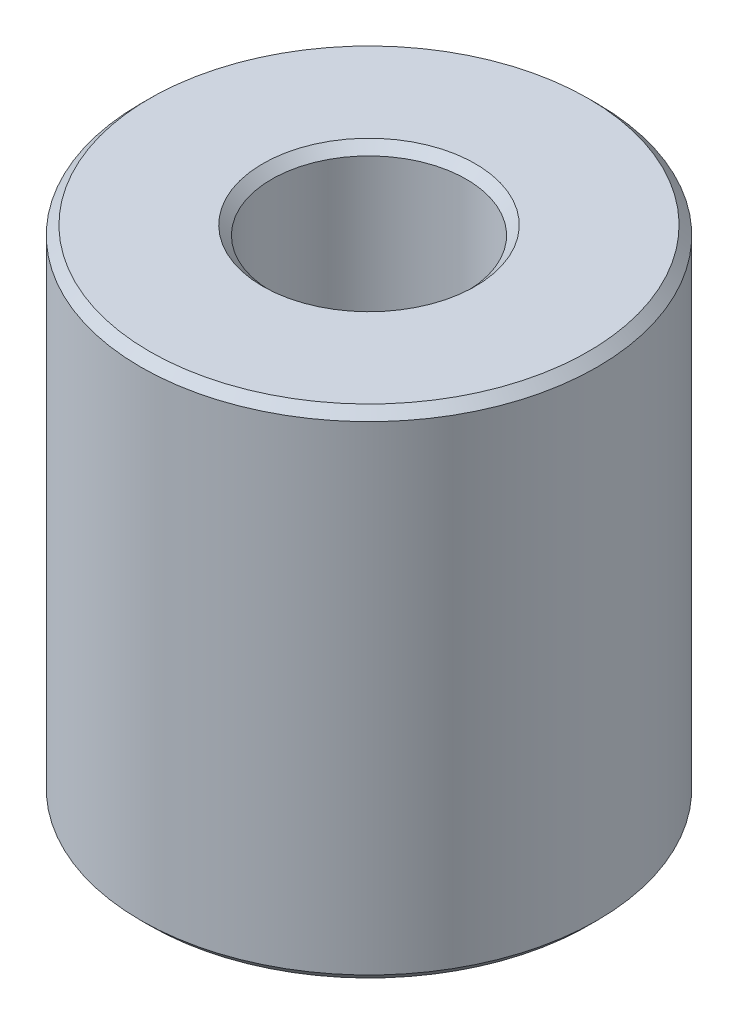
ISO-10303-21;
HEADER;
FILE_DESCRIPTION(('STEP AP214'),'2;1');
FILE_NAME('part.step','',(''),(''),'','','');
FILE_SCHEMA(('AUTOMOTIVE_DESIGN { 1 0 10303 214 1 1 1 1 }'));
ENDSEC;
DATA;
#1=APPLICATION_CONTEXT('core data for automotive mechanical design processes');
#2=APPLICATION_PROTOCOL_DEFINITION('international standard','automotive_design',2000,#1);
#3=PRODUCT_CONTEXT('',#1,'mechanical');
#4=PRODUCT('Part','Part','',(#3));
#5=PRODUCT_RELATED_PRODUCT_CATEGORY('part','',(#4));
#6=PRODUCT_DEFINITION_FORMATION('','',#4);
#7=PRODUCT_DEFINITION_CONTEXT('part definition',#1,'design');
#8=PRODUCT_DEFINITION('design','',#6,#7);
#9=PRODUCT_DEFINITION_SHAPE('','',#8);
#10=(LENGTH_UNIT() NAMED_UNIT(*) SI_UNIT(.MILLI.,.METRE.));
#11=(NAMED_UNIT(*) PLANE_ANGLE_UNIT() SI_UNIT($,.RADIAN.));
#12=(NAMED_UNIT(*) SI_UNIT($,.STERADIAN.) SOLID_ANGLE_UNIT());
#13=UNCERTAINTY_MEASURE_WITH_UNIT(LENGTH_MEASURE(1.E-05),#10,'distance_accuracy_value','');
#14=(GEOMETRIC_REPRESENTATION_CONTEXT(3) GLOBAL_UNCERTAINTY_ASSIGNED_CONTEXT((#13)) GLOBAL_UNIT_ASSIGNED_CONTEXT((#10,
#11,#12)) REPRESENTATION_CONTEXT('',''));
#15=CARTESIAN_POINT('',(0.,0.,0.));
#16=DIRECTION('',(0.,0.,1.));
#17=DIRECTION('',(1.,0.,0.));
#18=AXIS2_PLACEMENT_3D('',#15,#16,#17);
#19=CARTESIAN_POINT('',(0.,59.89815823762,0.));
#20=DIRECTION('',(0.,-1.,0.));
#21=DIRECTION('',(0.,0.,-1.));
#22=AXIS2_PLACEMENT_3D('',#19,#20,#21);
#23=CYLINDRICAL_SURFACE('',#22,27.5);
#24=CARTESIAN_POINT('',(0.,1.0791281320796,0.));
#25=DIRECTION('',(0.,1.,0.));
#26=DIRECTION('',(0.,0.,1.));
#27=AXIS2_PLACEMENT_3D('',#24,#25,#26);
#28=CIRCLE('',#27,27.5);
#29=CARTESIAN_POINT('',(0.,1.0791281320796,27.5));
#30=VERTEX_POINT('',#29);
#31=EDGE_CURVE('E10',#30,#30,#28,.T.);
#32=ORIENTED_EDGE('',*,*,#31,.T.);
#33=EDGE_LOOP('',(#32));
#34=FACE_BOUND('',#33,.T.);
#35=CARTESIAN_POINT('',(0.,58.8190301055405,0.));
#36=DIRECTION('',(0.,1.,0.));
#37=DIRECTION('',(0.,0.,1.));
#38=AXIS2_PLACEMENT_3D('',#35,#36,#37);
#39=CIRCLE('',#38,27.5);
#40=CARTESIAN_POINT('',(0.,58.8190301055405,-27.5));
#41=VERTEX_POINT('',#40);
#42=EDGE_CURVE('E50',#41,#41,#39,.F.);
#43=ORIENTED_EDGE('',*,*,#42,.T.);
#44=EDGE_LOOP('',(#43));
#45=FACE_BOUND('',#44,.T.);
#46=ADVANCED_FACE('F39',(#34,#45),#23,.T.);
#47=CARTESIAN_POINT('',(0.,59.89815823762,0.));
#48=DIRECTION('',(0.,1.,0.));
#49=DIRECTION('',(0.,0.,1.));
#50=AXIS2_PLACEMENT_3D('',#47,#48,#49);
#51=PLANE('',#50);
#52=CARTESIAN_POINT('',(0.,59.89815823762,0.));
#53=DIRECTION('',(0.,1.,0.));
#54=DIRECTION('',(0.,0.,1.));
#55=AXIS2_PLACEMENT_3D('',#52,#53,#54);
#56=CIRCLE('',#55,12.8058354694121);
#57=CARTESIAN_POINT('',(0.,59.89815823762,12.8058354694121));
#58=VERTEX_POINT('',#57);
#59=EDGE_CURVE('E58',#58,#58,#56,.F.);
#60=ORIENTED_EDGE('',*,*,#59,.T.);
#61=EDGE_LOOP('',(#60));
#62=FACE_BOUND('',#61,.T.);
#63=CARTESIAN_POINT('',(0.,59.89815823762,0.));
#64=DIRECTION('',(0.,1.,0.));
#65=DIRECTION('',(0.,0.,1.));
#66=AXIS2_PLACEMENT_3D('',#63,#64,#65);
#67=CIRCLE('',#66,26.4208718679204);
#68=CARTESIAN_POINT('',(0.,59.89815823762,-26.4208718679204));
#69=VERTEX_POINT('',#68);
#70=EDGE_CURVE('E61',#69,#69,#67,.T.);
#71=ORIENTED_EDGE('',*,*,#70,.T.);
#72=EDGE_LOOP('',(#71));
#73=FACE_BOUND('',#72,.T.);
#74=ADVANCED_FACE('F88',(#62,#73),#51,.T.);
#75=CARTESIAN_POINT('',(0.,0.,0.));
#76=DIRECTION('',(0.,1.,0.));
#77=DIRECTION('',(0.,0.,1.));
#78=AXIS2_PLACEMENT_3D('',#75,#76,#77);
#79=PLANE('',#78);
#80=CARTESIAN_POINT('',(0.,0.,0.));
#81=DIRECTION('',(0.,1.,0.));
#82=DIRECTION('',(0.,0.,1.));
#83=AXIS2_PLACEMENT_3D('',#80,#81,#82);
#84=CIRCLE('',#83,12.805835469412);
#85=CARTESIAN_POINT('',(0.,0.,12.805835469412));
#86=VERTEX_POINT('',#85);
#87=EDGE_CURVE('E51',#86,#86,#84,.T.);
#88=ORIENTED_EDGE('',*,*,#87,.T.);
#89=EDGE_LOOP('',(#88));
#90=FACE_BOUND('',#89,.T.);
#91=CARTESIAN_POINT('',(0.,0.,0.));
#92=DIRECTION('',(0.,1.,0.));
#93=DIRECTION('',(0.,0.,1.));
#94=AXIS2_PLACEMENT_3D('',#91,#92,#93);
#95=CIRCLE('',#94,26.4208718679204);
#96=CARTESIAN_POINT('',(0.,0.,26.4208718679204));
#97=VERTEX_POINT('',#96);
#98=EDGE_CURVE('E54',#97,#97,#95,.F.);
#99=ORIENTED_EDGE('',*,*,#98,.T.);
#100=EDGE_LOOP('',(#99));
#101=FACE_BOUND('',#100,.T.);
#102=ADVANCED_FACE('F83',(#90,#101),#79,.F.);
#103=CARTESIAN_POINT('',(0.,59.89815823762,0.));
#104=DIRECTION('',(0.,-1.,0.));
#105=DIRECTION('',(0.,0.,-1.));
#106=AXIS2_PLACEMENT_3D('',#103,#104,#105);
#107=CYLINDRICAL_SURFACE('',#106,11.7267073373325);
#108=CARTESIAN_POINT('',(0.,58.8190301055405,0.));
#109=DIRECTION('',(0.,1.,0.));
#110=DIRECTION('',(0.,0.,1.));
#111=AXIS2_PLACEMENT_3D('',#108,#109,#110);
#112=CIRCLE('',#111,11.7267073373325);
#113=CARTESIAN_POINT('',(0.,58.8190301055405,11.7267073373325));
#114=VERTEX_POINT('',#113);
#115=EDGE_CURVE('E67',#114,#114,#112,.T.);
#116=ORIENTED_EDGE('',*,*,#115,.T.);
#117=EDGE_LOOP('',(#116));
#118=FACE_BOUND('',#117,.T.);
#119=CARTESIAN_POINT('',(0.,1.0791281320796,0.));
#120=DIRECTION('',(0.,1.,0.));
#121=DIRECTION('',(0.,0.,1.));
#122=AXIS2_PLACEMENT_3D('',#119,#120,#121);
#123=CIRCLE('',#122,11.7267073373325);
#124=CARTESIAN_POINT('',(0.,1.0791281320796,11.7267073373325));
#125=VERTEX_POINT('',#124);
#126=EDGE_CURVE('E69',#125,#125,#123,.F.);
#127=ORIENTED_EDGE('',*,*,#126,.T.);
#128=EDGE_LOOP('',(#127));
#129=FACE_BOUND('',#128,.T.);
#130=ADVANCED_FACE('F71',(#118,#129),#107,.F.);
#131=CARTESIAN_POINT('',(0.,58.8190301055405,0.));
#132=DIRECTION('',(0.,1.,0.));
#133=DIRECTION('',(0.,0.,1.));
#134=AXIS2_PLACEMENT_3D('',#131,#132,#133);
#135=CONICAL_SURFACE('',#134,11.7267073373325,0.785398163397463);
#136=ORIENTED_EDGE('',*,*,#59,.F.);
#137=EDGE_LOOP('',(#136));
#138=FACE_BOUND('',#137,.T.);
#139=ORIENTED_EDGE('',*,*,#115,.F.);
#140=EDGE_LOOP('',(#139));
#141=FACE_BOUND('',#140,.T.);
#142=ADVANCED_FACE('F77',(#138,#141),#135,.F.);
#143=CARTESIAN_POINT('',(0.,0.,0.));
#144=DIRECTION('',(0.,-1.,0.));
#145=DIRECTION('',(0.,0.,-1.));
#146=AXIS2_PLACEMENT_3D('',#143,#144,#145);
#147=CONICAL_SURFACE('',#146,12.805835469412,0.785398163397447);
#148=ORIENTED_EDGE('',*,*,#126,.F.);
#149=EDGE_LOOP('',(#148));
#150=FACE_BOUND('',#149,.T.);
#151=ORIENTED_EDGE('',*,*,#87,.F.);
#152=EDGE_LOOP('',(#151));
#153=FACE_BOUND('',#152,.T.);
#154=ADVANCED_FACE('F73',(#150,#153),#147,.F.);
#155=CARTESIAN_POINT('',(0.,1.0791281320796,0.));
#156=DIRECTION('',(0.,1.,0.));
#157=DIRECTION('',(0.,0.,1.));
#158=AXIS2_PLACEMENT_3D('',#155,#156,#157);
#159=CONICAL_SURFACE('',#158,27.5,0.78539816339745);
#160=ORIENTED_EDGE('',*,*,#98,.F.);
#161=EDGE_LOOP('',(#160));
#162=FACE_BOUND('',#161,.T.);
#163=ORIENTED_EDGE('',*,*,#31,.F.);
#164=EDGE_LOOP('',(#163));
#165=FACE_BOUND('',#164,.T.);
#166=ADVANCED_FACE('F76',(#162,#165),#159,.T.);
#167=CARTESIAN_POINT('',(0.,59.89815823762,0.));
#168=DIRECTION('',(0.,-1.,0.));
#169=DIRECTION('',(0.,0.,-1.));
#170=AXIS2_PLACEMENT_3D('',#167,#168,#169);
#171=CONICAL_SURFACE('',#170,26.4208718679204,0.785398163397434);
#172=CARTESIAN_POINT('',(0.,58.8190301055405,-27.5));
#173=CARTESIAN_POINT('',(0.,58.8302710235829,-27.4887590819575));
#174=CARTESIAN_POINT('',(0.,58.8415119416254,-27.477518163915));
#175=CARTESIAN_POINT('',(0.,58.8639937777104,-27.45503632783));
#176=CARTESIAN_POINT('',(0.,58.8752346957529,-27.4437954097875));
#177=CARTESIAN_POINT('',(0.,58.8977165318379,-27.4213135737025));
#178=CARTESIAN_POINT('',(0.,58.9089574498804,-27.41007265566));
#179=CARTESIAN_POINT('',(0.,58.9314392859654,-27.387590819575));
#180=CARTESIAN_POINT('',(0.,58.9426802040079,-27.3763499015326));
#181=CARTESIAN_POINT('',(0.,58.9651620400929,-27.3538680654476));
#182=CARTESIAN_POINT('',(0.,58.9764029581354,-27.3426271474051));
#183=CARTESIAN_POINT('',(0.,58.9988847942204,-27.3201453113201));
#184=CARTESIAN_POINT('',(0.,59.0101257122629,-27.3089043932776));
#185=CARTESIAN_POINT('',(0.,59.0326075483479,-27.2864225571926));
#186=CARTESIAN_POINT('',(0.,59.0438484663904,-27.2751816391501));
#187=CARTESIAN_POINT('',(0.,59.0663303024754,-27.2526998030651));
#188=CARTESIAN_POINT('',(0.,59.0775712205178,-27.2414588850226));
#189=CARTESIAN_POINT('',(0.,59.1000530566028,-27.2189770489376));
#190=CARTESIAN_POINT('',(0.,59.1112939746453,-27.2077361308951));
#191=CARTESIAN_POINT('',(0.,59.1337758107303,-27.1852542948101));
#192=CARTESIAN_POINT('',(0.,59.1450167287728,-27.1740133767676));
#193=CARTESIAN_POINT('',(0.,59.1674985648578,-27.1515315406826));
#194=CARTESIAN_POINT('',(0.,59.1787394829003,-27.1402906226402));
#195=CARTESIAN_POINT('',(0.,59.2012213189853,-27.1178087865552));
#196=CARTESIAN_POINT('',(0.,59.2124622370278,-27.1065678685127));
#197=CARTESIAN_POINT('',(0.,59.2349440731128,-27.0840860324277));
#198=CARTESIAN_POINT('',(0.,59.2461849911553,-27.0728451143852));
#199=CARTESIAN_POINT('',(0.,59.2686668272403,-27.0503632783002));
#200=CARTESIAN_POINT('',(0.,59.2799077452828,-27.0391223602577));
#201=CARTESIAN_POINT('',(0.,59.3023895813678,-27.0166405241727));
#202=CARTESIAN_POINT('',(0.,59.3136304994103,-27.0053996061302));
#203=CARTESIAN_POINT('',(0.,59.3361123354953,-26.9829177700452));
#204=CARTESIAN_POINT('',(0.,59.3473532535377,-26.9716768520027));
#205=CARTESIAN_POINT('',(0.,59.3698350896227,-26.9491950159177));
#206=CARTESIAN_POINT('',(0.,59.3810760076652,-26.9379540978752));
#207=CARTESIAN_POINT('',(0.,59.4035578437502,-26.9154722617902));
#208=CARTESIAN_POINT('',(0.,59.4147987617927,-26.9042313437477));
#209=CARTESIAN_POINT('',(0.,59.4372805978777,-26.8817495076628));
#210=CARTESIAN_POINT('',(0.,59.4485215159202,-26.8705085896203));
#211=CARTESIAN_POINT('',(0.,59.4710033520052,-26.8480267535353));
#212=CARTESIAN_POINT('',(0.,59.4822442700477,-26.8367858354928));
#213=CARTESIAN_POINT('',(0.,59.5047261061327,-26.8143039994078));
#214=CARTESIAN_POINT('',(0.,59.5159670241752,-26.8030630813653));
#215=CARTESIAN_POINT('',(0.,59.5384488602602,-26.7805812452803));
#216=CARTESIAN_POINT('',(0.,59.5496897783027,-26.7693403272378));
#217=CARTESIAN_POINT('',(0.,59.5721716143877,-26.7468584911528));
#218=CARTESIAN_POINT('',(0.,59.5834125324302,-26.7356175731103));
#219=CARTESIAN_POINT('',(0.,59.6058943685152,-26.7131357370253));
#220=CARTESIAN_POINT('',(0.,59.6171352865576,-26.7018948189828));
#221=CARTESIAN_POINT('',(0.,59.6396171226426,-26.6794129828978));
#222=CARTESIAN_POINT('',(0.,59.6508580406851,-26.6681720648553));
#223=CARTESIAN_POINT('',(0.,59.6733398767701,-26.6456902287704));
#224=CARTESIAN_POINT('',(0.,59.6845807948126,-26.6344493107279));
#225=CARTESIAN_POINT('',(0.,59.7070626308976,-26.6119674746429));
#226=CARTESIAN_POINT('',(0.,59.7183035489401,-26.6007265566004));
#227=CARTESIAN_POINT('',(0.,59.7407853850251,-26.5782447205154));
#228=CARTESIAN_POINT('',(0.,59.7520263030676,-26.5670038024729));
#229=CARTESIAN_POINT('',(0.,59.7745081391526,-26.5445219663879));
#230=CARTESIAN_POINT('',(0.,59.7857490571951,-26.5332810483454));
#231=CARTESIAN_POINT('',(0.,59.8082308932801,-26.5107992122604));
#232=CARTESIAN_POINT('',(0.,59.8194718113226,-26.4995582942179));
#233=CARTESIAN_POINT('',(0.,59.8419536474076,-26.4770764581329));
#234=CARTESIAN_POINT('',(0.,59.8531945654501,-26.4658355400904));
#235=CARTESIAN_POINT('',(0.,59.8756764015351,-26.4433537040054));
#236=CARTESIAN_POINT('',(0.,59.8869173195775,-26.4321127859629));
#237=CARTESIAN_POINT('',(0.,59.89815823762,-26.4208718679204));
#238=B_SPLINE_CURVE_WITH_KNOTS('',3,(#172,#173,#174,#175,#176,#177,#178,#179,#180,#181,#182,
#183,#184,#185,#186,#187,#188,#189,#190,#191,#192,#193,#194,#195,#196,#197,#198,#199,#200,#201,
#202,#203,#204,#205,#206,#207,#208,#209,#210,#211,#212,#213,#214,#215,#216,#217,#218,#219,#220,
#221,#222,#223,#224,#225,#226,#227,#228,#229,#230,#231,#232,#233,#234,#235,#236,#237),
.UNSPECIFIED.,.F.,.F.,(4,2,2,2,2,2,2,2,2,2,2,2,2,2,2,2,2,2,2,2,2,2,2,2,2,2,2,2,2,2,2,2,4),(0.,
0.0476911762476616,0.0953823524953281,0.14307352874299,0.190764704990656,0.238455881238323,
0.286147057485984,0.333838233733651,0.381529409981317,0.429220586228979,0.476911762476646,
0.524602938724312,0.572294114971974,0.61998529121964,0.667676467467307,0.715367643714971,
0.763058819962637,0.810749996210304,0.858441172457965,0.906132348705632,0.953823524953298,
1.00151470120096,1.04920587744863,1.09689705369629,1.14458822994395,1.19227940619162,
1.23997058243929,1.28766175868695,1.33535293493462,1.38304411118228,1.43073528742994,
1.47842646367761,1.52611763992528),.UNSPECIFIED.);
#239=EDGE_CURVE('BSEAM45',#41,#69,#238,.T.);
#240=ORIENTED_EDGE('',*,*,#42,.F.);
#241=ORIENTED_EDGE('',*,*,#70,.F.);
#242=ORIENTED_EDGE('',*,*,#239,.T.);
#243=ORIENTED_EDGE('',*,*,#239,.F.);
#244=EDGE_LOOP('',(#240,#242,#241,#243));
#245=FACE_BOUND('',#244,.T.);
#246=ADVANCED_FACE('F45',(#245),#171,.T.);
#247=CLOSED_SHELL('',(#46,#74,#102,#130,#142,#154,#166,#246));
#248=MANIFOLD_SOLID_BREP('B2',#247);
#249=ADVANCED_BREP_SHAPE_REPRESENTATION('',(#18,#248),#14);
#250=SHAPE_DEFINITION_REPRESENTATION(#9,#249);
ENDSEC;
END-ISO-10303-21;
